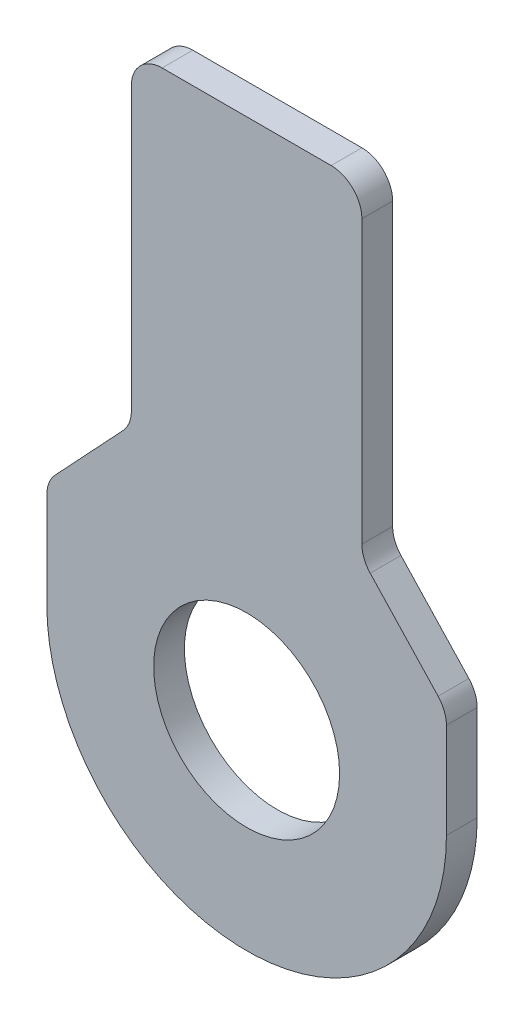
ISO-10303-21;
HEADER;
FILE_DESCRIPTION(('STEP AP214'),'2;1');
FILE_NAME('part.step','',(''),(''),'','','');
FILE_SCHEMA(('AUTOMOTIVE_DESIGN { 1 0 10303 214 1 1 1 1 }'));
ENDSEC;
DATA;
#1=APPLICATION_CONTEXT('core data for automotive mechanical design processes');
#2=APPLICATION_PROTOCOL_DEFINITION('international standard','automotive_design',2000,#1);
#3=PRODUCT_CONTEXT('',#1,'mechanical');
#4=PRODUCT('Part','Part','',(#3));
#5=PRODUCT_RELATED_PRODUCT_CATEGORY('part','',(#4));
#6=PRODUCT_DEFINITION_FORMATION('','',#4);
#7=PRODUCT_DEFINITION_CONTEXT('part definition',#1,'design');
#8=PRODUCT_DEFINITION('design','',#6,#7);
#9=PRODUCT_DEFINITION_SHAPE('','',#8);
#10=(LENGTH_UNIT() NAMED_UNIT(*) SI_UNIT(.MILLI.,.METRE.));
#11=(NAMED_UNIT(*) PLANE_ANGLE_UNIT() SI_UNIT($,.RADIAN.));
#12=(NAMED_UNIT(*) SI_UNIT($,.STERADIAN.) SOLID_ANGLE_UNIT());
#13=UNCERTAINTY_MEASURE_WITH_UNIT(LENGTH_MEASURE(1.E-05),#10,'distance_accuracy_value','');
#14=(GEOMETRIC_REPRESENTATION_CONTEXT(3) GLOBAL_UNCERTAINTY_ASSIGNED_CONTEXT((#13)) GLOBAL_UNIT_ASSIGNED_CONTEXT((#10,
#11,#12)) REPRESENTATION_CONTEXT('',''));
#15=CARTESIAN_POINT('',(0.,0.,0.));
#16=DIRECTION('',(0.,0.,1.));
#17=DIRECTION('',(1.,0.,0.));
#18=AXIS2_PLACEMENT_3D('',#15,#16,#17);
#19=CARTESIAN_POINT('',(0.,0.,-1.));
#20=DIRECTION('',(0.,0.,1.));
#21=DIRECTION('',(1.,0.,0.));
#22=AXIS2_PLACEMENT_3D('',#19,#20,#21);
#23=CYLINDRICAL_SURFACE('',#22,6.5);
#24=CARTESIAN_POINT('',(0.,0.,0.));
#25=DIRECTION('',(0.,0.,1.));
#26=DIRECTION('',(1.,0.,0.));
#27=AXIS2_PLACEMENT_3D('',#24,#25,#26);
#28=CIRCLE('',#27,6.5);
#29=CARTESIAN_POINT('',(-6.5,0.,0.));
#30=VERTEX_POINT('',#29);
#31=CARTESIAN_POINT('',(6.5,0.,0.));
#32=VERTEX_POINT('',#31);
#33=EDGE_CURVE('E183',#30,#32,#28,.T.);
#34=ORIENTED_EDGE('',*,*,#33,.F.);
#35=DIRECTION('',(0.,0.,1.));
#36=VECTOR('',#35,1.);
#37=CARTESIAN_POINT('',(-6.5,0.,-1.));
#38=LINE('',#37,#36);
#39=CARTESIAN_POINT('',(-6.5,0.,-1.));
#40=VERTEX_POINT('',#39);
#41=EDGE_CURVE('E11',#40,#30,#38,.T.);
#42=ORIENTED_EDGE('',*,*,#41,.F.);
#43=CARTESIAN_POINT('',(0.,0.,-1.));
#44=DIRECTION('',(0.,0.,1.));
#45=DIRECTION('',(1.,0.,0.));
#46=AXIS2_PLACEMENT_3D('',#43,#44,#45);
#47=CIRCLE('',#46,6.5);
#48=CARTESIAN_POINT('',(6.5,0.,-1.));
#49=VERTEX_POINT('',#48);
#50=EDGE_CURVE('E235',#40,#49,#47,.T.);
#51=ORIENTED_EDGE('',*,*,#50,.T.);
#52=DIRECTION('',(0.,0.,1.));
#53=VECTOR('',#52,1.);
#54=CARTESIAN_POINT('',(6.5,0.,-1.));
#55=LINE('',#54,#53);
#56=EDGE_CURVE('E45',#49,#32,#55,.T.);
#57=ORIENTED_EDGE('',*,*,#56,.T.);
#58=EDGE_LOOP('',(#34,#42,#51,#57));
#59=FACE_BOUND('',#58,.T.);
#60=ADVANCED_FACE('F42',(#59),#23,.T.);
#61=CARTESIAN_POINT('',(-6.5,3.10504850213721,-1.));
#62=DIRECTION('',(-1.,0.,0.));
#63=DIRECTION('',(0.,0.,1.));
#64=AXIS2_PLACEMENT_3D('',#61,#62,#63);
#65=PLANE('',#64);
#66=DIRECTION('',(0.,-1.,0.));
#67=VECTOR('',#66,1.);
#68=CARTESIAN_POINT('',(-6.5,3.10504850213721,0.));
#69=LINE('',#68,#67);
#70=CARTESIAN_POINT('',(-6.5,3.10504850213721,0.));
#71=VERTEX_POINT('',#70);
#72=EDGE_CURVE('E232',#71,#30,#69,.T.);
#73=ORIENTED_EDGE('',*,*,#72,.F.);
#74=DIRECTION('',(0.,0.,1.));
#75=VECTOR('',#74,1.);
#76=CARTESIAN_POINT('',(-6.5,3.10504850213721,-1.));
#77=LINE('',#76,#75);
#78=CARTESIAN_POINT('',(-6.5,3.10504850213721,-1.));
#79=VERTEX_POINT('',#78);
#80=EDGE_CURVE('E52',#79,#71,#77,.T.);
#81=ORIENTED_EDGE('',*,*,#80,.F.);
#82=DIRECTION('',(0.,-1.,0.));
#83=VECTOR('',#82,1.);
#84=CARTESIAN_POINT('',(-6.5,3.10504850213721,-1.));
#85=LINE('',#84,#83);
#86=EDGE_CURVE('E167',#79,#40,#85,.T.);
#87=ORIENTED_EDGE('',*,*,#86,.T.);
#88=ORIENTED_EDGE('',*,*,#41,.T.);
#89=EDGE_LOOP('',(#73,#81,#87,#88));
#90=FACE_BOUND('',#89,.T.);
#91=ADVANCED_FACE('F271',(#90),#65,.T.);
#92=CARTESIAN_POINT('',(-5.5,3.10504850213721,-1.));
#93=DIRECTION('',(0.,0.,1.));
#94=DIRECTION('',(1.,0.,0.));
#95=AXIS2_PLACEMENT_3D('',#92,#93,#94);
#96=CYLINDRICAL_SURFACE('',#95,0.999999999999999);
#97=CARTESIAN_POINT('',(-5.5,3.10504850213721,0.));
#98=DIRECTION('',(0.,0.,1.));
#99=DIRECTION('',(1.,0.,0.));
#100=AXIS2_PLACEMENT_3D('',#97,#98,#99);
#101=CIRCLE('',#100,0.999999999999999);
#102=CARTESIAN_POINT('',(-6.23012373308702,3.78836346200789,0.));
#103=VERTEX_POINT('',#102);
#104=EDGE_CURVE('E153',#103,#71,#101,.T.);
#105=ORIENTED_EDGE('',*,*,#104,.F.);
#106=DIRECTION('',(0.,0.,1.));
#107=VECTOR('',#106,1.);
#108=CARTESIAN_POINT('',(-6.23012373308702,3.78836346200789,-1.));
#109=LINE('',#108,#107);
#110=CARTESIAN_POINT('',(-6.23012373308702,3.78836346200789,-1.));
#111=VERTEX_POINT('',#110);
#112=EDGE_CURVE('E148',#111,#103,#109,.T.);
#113=ORIENTED_EDGE('',*,*,#112,.F.);
#114=CARTESIAN_POINT('',(-5.5,3.10504850213721,-1.));
#115=DIRECTION('',(0.,0.,1.));
#116=DIRECTION('',(1.,0.,0.));
#117=AXIS2_PLACEMENT_3D('',#114,#115,#116);
#118=CIRCLE('',#117,0.999999999999999);
#119=EDGE_CURVE('E151',#111,#79,#118,.T.);
#120=ORIENTED_EDGE('',*,*,#119,.T.);
#121=ORIENTED_EDGE('',*,*,#80,.T.);
#122=EDGE_LOOP('',(#105,#113,#120,#121));
#123=FACE_BOUND('',#122,.T.);
#124=ADVANCED_FACE('F150',(#123),#96,.T.);
#125=CARTESIAN_POINT('',(-4.01987626691298,6.15001837346265,-1.));
#126=DIRECTION('',(-0.73012373308702,0.683314959870684,0.));
#127=DIRECTION('',(-0.683314959870684,-0.73012373308702,0.));
#128=AXIS2_PLACEMENT_3D('',#125,#126,#127);
#129=PLANE('',#128);
#130=DIRECTION('',(-0.683314959870684,-0.730123733087019,0.));
#131=VECTOR('',#130,1.);
#132=CARTESIAN_POINT('',(-4.01987626691298,6.15001837346265,0.));
#133=LINE('',#132,#131);
#134=CARTESIAN_POINT('',(-4.01987626691298,6.15001837346265,0.));
#135=VERTEX_POINT('',#134);
#136=EDGE_CURVE('E227',#135,#103,#133,.T.);
#137=ORIENTED_EDGE('',*,*,#136,.F.);
#138=DIRECTION('',(0.,0.,1.));
#139=VECTOR('',#138,1.);
#140=CARTESIAN_POINT('',(-4.01987626691298,6.15001837346265,-1.));
#141=LINE('',#140,#139);
#142=CARTESIAN_POINT('',(-4.01987626691298,6.15001837346265,-1.));
#143=VERTEX_POINT('',#142);
#144=EDGE_CURVE('E159',#143,#135,#141,.T.);
#145=ORIENTED_EDGE('',*,*,#144,.F.);
#146=DIRECTION('',(-0.683314959870684,-0.730123733087019,0.));
#147=VECTOR('',#146,1.);
#148=CARTESIAN_POINT('',(-4.01987626691298,6.15001837346265,-1.));
#149=LINE('',#148,#147);
#150=EDGE_CURVE('E165',#143,#111,#149,.T.);
#151=ORIENTED_EDGE('',*,*,#150,.T.);
#152=ORIENTED_EDGE('',*,*,#112,.T.);
#153=EDGE_LOOP('',(#137,#145,#151,#152));
#154=FACE_BOUND('',#153,.T.);
#155=ADVANCED_FACE('F170',(#154),#129,.T.);
#156=CARTESIAN_POINT('',(-4.75,6.83333333333334,-1.));
#157=DIRECTION('',(0.,0.,1.));
#158=DIRECTION('',(1.,0.,0.));
#159=AXIS2_PLACEMENT_3D('',#156,#157,#158);
#160=CYLINDRICAL_SURFACE('',#159,0.999999999999999);
#161=CARTESIAN_POINT('',(-4.75,6.83333333333334,0.));
#162=DIRECTION('',(0.,0.,-1.));
#163=DIRECTION('',(-1.,0.,0.));
#164=AXIS2_PLACEMENT_3D('',#161,#162,#163);
#165=CIRCLE('',#164,0.999999999999999);
#166=CARTESIAN_POINT('',(-3.75,6.83333333333334,0.));
#167=VERTEX_POINT('',#166);
#168=EDGE_CURVE('E223',#167,#135,#165,.T.);
#169=ORIENTED_EDGE('',*,*,#168,.F.);
#170=DIRECTION('',(0.,0.,1.));
#171=VECTOR('',#170,1.);
#172=CARTESIAN_POINT('',(-3.75,6.83333333333334,-1.));
#173=LINE('',#172,#171);
#174=CARTESIAN_POINT('',(-3.75,6.83333333333334,-1.));
#175=VERTEX_POINT('',#174);
#176=EDGE_CURVE('E241',#175,#167,#173,.T.);
#177=ORIENTED_EDGE('',*,*,#176,.F.);
#178=CARTESIAN_POINT('',(-4.75,6.83333333333334,-1.));
#179=DIRECTION('',(0.,0.,-1.));
#180=DIRECTION('',(-1.,0.,0.));
#181=AXIS2_PLACEMENT_3D('',#178,#179,#180);
#182=CIRCLE('',#181,0.999999999999999);
#183=EDGE_CURVE('E172',#175,#143,#182,.T.);
#184=ORIENTED_EDGE('',*,*,#183,.T.);
#185=ORIENTED_EDGE('',*,*,#144,.T.);
#186=EDGE_LOOP('',(#169,#177,#184,#185));
#187=FACE_BOUND('',#186,.T.);
#188=ADVANCED_FACE('F284',(#187),#160,.F.);
#189=CARTESIAN_POINT('',(-3.75,6.83333333333334,-1.));
#190=DIRECTION('',(-1.,0.,0.));
#191=DIRECTION('',(0.,-1.,0.));
#192=AXIS2_PLACEMENT_3D('',#189,#190,#191);
#193=PLANE('',#192);
#194=DIRECTION('',(0.,-1.,0.));
#195=VECTOR('',#194,1.);
#196=CARTESIAN_POINT('',(-3.75,6.83333333333334,0.));
#197=LINE('',#196,#195);
#198=CARTESIAN_POINT('',(-3.75,16.,0.));
#199=VERTEX_POINT('',#198);
#200=EDGE_CURVE('E219',#199,#167,#197,.T.);
#201=ORIENTED_EDGE('',*,*,#200,.F.);
#202=DIRECTION('',(0.,0.,1.));
#203=VECTOR('',#202,1.);
#204=CARTESIAN_POINT('',(-3.75,16.,-1.));
#205=LINE('',#204,#203);
#206=CARTESIAN_POINT('',(-3.75,16.,-1.));
#207=VERTEX_POINT('',#206);
#208=EDGE_CURVE('E244',#207,#199,#205,.T.);
#209=ORIENTED_EDGE('',*,*,#208,.F.);
#210=DIRECTION('',(0.,-1.,0.));
#211=VECTOR('',#210,1.);
#212=CARTESIAN_POINT('',(-3.75,6.83333333333334,-1.));
#213=LINE('',#212,#211);
#214=EDGE_CURVE('E177',#207,#175,#213,.T.);
#215=ORIENTED_EDGE('',*,*,#214,.T.);
#216=ORIENTED_EDGE('',*,*,#176,.T.);
#217=EDGE_LOOP('',(#201,#209,#215,#216));
#218=FACE_BOUND('',#217,.T.);
#219=ADVANCED_FACE('F287',(#218),#193,.T.);
#220=CARTESIAN_POINT('',(-2.75,16.,-1.));
#221=DIRECTION('',(0.,0.,1.));
#222=DIRECTION('',(1.,0.,0.));
#223=AXIS2_PLACEMENT_3D('',#220,#221,#222);
#224=CYLINDRICAL_SURFACE('',#223,1.);
#225=CARTESIAN_POINT('',(-2.75,16.,0.));
#226=DIRECTION('',(0.,0.,1.));
#227=DIRECTION('',(-1.,0.,0.));
#228=AXIS2_PLACEMENT_3D('',#225,#226,#227);
#229=CIRCLE('',#228,1.);
#230=CARTESIAN_POINT('',(-2.75,17.,0.));
#231=VERTEX_POINT('',#230);
#232=EDGE_CURVE('E215',#231,#199,#229,.T.);
#233=ORIENTED_EDGE('',*,*,#232,.F.);
#234=DIRECTION('',(0.,0.,1.));
#235=VECTOR('',#234,1.);
#236=CARTESIAN_POINT('',(-2.75,17.,-1.));
#237=LINE('',#236,#235);
#238=CARTESIAN_POINT('',(-2.75,17.,-1.));
#239=VERTEX_POINT('',#238);
#240=EDGE_CURVE('E247',#239,#231,#237,.T.);
#241=ORIENTED_EDGE('',*,*,#240,.F.);
#242=CARTESIAN_POINT('',(-2.75,16.,-1.));
#243=DIRECTION('',(0.,0.,1.));
#244=DIRECTION('',(-1.,0.,0.));
#245=AXIS2_PLACEMENT_3D('',#242,#243,#244);
#246=CIRCLE('',#245,1.);
#247=EDGE_CURVE('E374',#239,#207,#246,.T.);
#248=ORIENTED_EDGE('',*,*,#247,.T.);
#249=ORIENTED_EDGE('',*,*,#208,.T.);
#250=EDGE_LOOP('',(#233,#241,#248,#249));
#251=FACE_BOUND('',#250,.T.);
#252=ADVANCED_FACE('F291',(#251),#224,.T.);
#253=CARTESIAN_POINT('',(2.75,17.,-1.));
#254=DIRECTION('',(0.,1.,0.));
#255=DIRECTION('',(0.,0.,1.));
#256=AXIS2_PLACEMENT_3D('',#253,#254,#255);
#257=PLANE('',#256);
#258=DIRECTION('',(-1.,0.,0.));
#259=VECTOR('',#258,1.);
#260=CARTESIAN_POINT('',(2.75,17.,0.));
#261=LINE('',#260,#259);
#262=CARTESIAN_POINT('',(2.75,17.,0.));
#263=VERTEX_POINT('',#262);
#264=EDGE_CURVE('E211',#263,#231,#261,.T.);
#265=ORIENTED_EDGE('',*,*,#264,.F.);
#266=DIRECTION('',(0.,0.,1.));
#267=VECTOR('',#266,1.);
#268=CARTESIAN_POINT('',(2.75,17.,-1.));
#269=LINE('',#268,#267);
#270=CARTESIAN_POINT('',(2.75,17.,-1.));
#271=VERTEX_POINT('',#270);
#272=EDGE_CURVE('E249',#271,#263,#269,.T.);
#273=ORIENTED_EDGE('',*,*,#272,.F.);
#274=DIRECTION('',(-1.,0.,0.));
#275=VECTOR('',#274,1.);
#276=CARTESIAN_POINT('',(2.75,17.,-1.));
#277=LINE('',#276,#275);
#278=EDGE_CURVE('E370',#271,#239,#277,.T.);
#279=ORIENTED_EDGE('',*,*,#278,.T.);
#280=ORIENTED_EDGE('',*,*,#240,.T.);
#281=EDGE_LOOP('',(#265,#273,#279,#280));
#282=FACE_BOUND('',#281,.T.);
#283=ADVANCED_FACE('F295',(#282),#257,.T.);
#284=CARTESIAN_POINT('',(2.75,16.,-1.));
#285=DIRECTION('',(0.,0.,1.));
#286=DIRECTION('',(1.,0.,0.));
#287=AXIS2_PLACEMENT_3D('',#284,#285,#286);
#288=CYLINDRICAL_SURFACE('',#287,1.);
#289=CARTESIAN_POINT('',(2.75,16.,0.));
#290=DIRECTION('',(0.,0.,1.));
#291=DIRECTION('',(-1.,0.,0.));
#292=AXIS2_PLACEMENT_3D('',#289,#290,#291);
#293=CIRCLE('',#292,1.);
#294=CARTESIAN_POINT('',(3.75,16.,0.));
#295=VERTEX_POINT('',#294);
#296=EDGE_CURVE('E207',#295,#263,#293,.T.);
#297=ORIENTED_EDGE('',*,*,#296,.F.);
#298=DIRECTION('',(0.,0.,1.));
#299=VECTOR('',#298,1.);
#300=CARTESIAN_POINT('',(3.75,16.,-1.));
#301=LINE('',#300,#299);
#302=CARTESIAN_POINT('',(3.75,16.,-1.));
#303=VERTEX_POINT('',#302);
#304=EDGE_CURVE('E252',#303,#295,#301,.T.);
#305=ORIENTED_EDGE('',*,*,#304,.F.);
#306=CARTESIAN_POINT('',(2.75,16.,-1.));
#307=DIRECTION('',(0.,0.,1.));
#308=DIRECTION('',(-1.,0.,0.));
#309=AXIS2_PLACEMENT_3D('',#306,#307,#308);
#310=CIRCLE('',#309,1.);
#311=EDGE_CURVE('E366',#303,#271,#310,.T.);
#312=ORIENTED_EDGE('',*,*,#311,.T.);
#313=ORIENTED_EDGE('',*,*,#272,.T.);
#314=EDGE_LOOP('',(#297,#305,#312,#313));
#315=FACE_BOUND('',#314,.T.);
#316=ADVANCED_FACE('F299',(#315),#288,.T.);
#317=CARTESIAN_POINT('',(3.75,6.83333333333334,-1.));
#318=DIRECTION('',(1.,0.,0.));
#319=DIRECTION('',(0.,1.,0.));
#320=AXIS2_PLACEMENT_3D('',#317,#318,#319);
#321=PLANE('',#320);
#322=DIRECTION('',(0.,1.,0.));
#323=VECTOR('',#322,1.);
#324=CARTESIAN_POINT('',(3.75,6.83333333333334,0.));
#325=LINE('',#324,#323);
#326=CARTESIAN_POINT('',(3.75,6.83333333333334,0.));
#327=VERTEX_POINT('',#326);
#328=EDGE_CURVE('E203',#327,#295,#325,.T.);
#329=ORIENTED_EDGE('',*,*,#328,.F.);
#330=DIRECTION('',(0.,0.,1.));
#331=VECTOR('',#330,1.);
#332=CARTESIAN_POINT('',(3.75,6.83333333333334,-1.));
#333=LINE('',#332,#331);
#334=CARTESIAN_POINT('',(3.75,6.83333333333334,-1.));
#335=VERTEX_POINT('',#334);
#336=EDGE_CURVE('E255',#335,#327,#333,.T.);
#337=ORIENTED_EDGE('',*,*,#336,.F.);
#338=DIRECTION('',(0.,1.,0.));
#339=VECTOR('',#338,1.);
#340=CARTESIAN_POINT('',(3.75,6.83333333333334,-1.));
#341=LINE('',#340,#339);
#342=EDGE_CURVE('E362',#335,#303,#341,.T.);
#343=ORIENTED_EDGE('',*,*,#342,.T.);
#344=ORIENTED_EDGE('',*,*,#304,.T.);
#345=EDGE_LOOP('',(#329,#337,#343,#344));
#346=FACE_BOUND('',#345,.T.);
#347=ADVANCED_FACE('F303',(#346),#321,.T.);
#348=CARTESIAN_POINT('',(4.75,6.83333333333334,-1.));
#349=DIRECTION('',(0.,0.,1.));
#350=DIRECTION('',(1.,0.,0.));
#351=AXIS2_PLACEMENT_3D('',#348,#349,#350);
#352=CYLINDRICAL_SURFACE('',#351,0.999999999999999);
#353=CARTESIAN_POINT('',(4.75,6.83333333333334,0.));
#354=DIRECTION('',(0.,0.,-1.));
#355=DIRECTION('',(-1.,0.,0.));
#356=AXIS2_PLACEMENT_3D('',#353,#354,#355);
#357=CIRCLE('',#356,0.999999999999999);
#358=CARTESIAN_POINT('',(4.01987626691298,6.15001837346265,0.));
#359=VERTEX_POINT('',#358);
#360=EDGE_CURVE('E199',#359,#327,#357,.T.);
#361=ORIENTED_EDGE('',*,*,#360,.F.);
#362=DIRECTION('',(0.,0.,1.));
#363=VECTOR('',#362,1.);
#364=CARTESIAN_POINT('',(4.01987626691298,6.15001837346265,-1.));
#365=LINE('',#364,#363);
#366=CARTESIAN_POINT('',(4.01987626691298,6.15001837346265,-1.));
#367=VERTEX_POINT('',#366);
#368=EDGE_CURVE('E258',#367,#359,#365,.T.);
#369=ORIENTED_EDGE('',*,*,#368,.F.);
#370=CARTESIAN_POINT('',(4.75,6.83333333333334,-1.));
#371=DIRECTION('',(0.,0.,-1.));
#372=DIRECTION('',(-1.,0.,0.));
#373=AXIS2_PLACEMENT_3D('',#370,#371,#372);
#374=CIRCLE('',#373,0.999999999999999);
#375=EDGE_CURVE('E358',#367,#335,#374,.T.);
#376=ORIENTED_EDGE('',*,*,#375,.T.);
#377=ORIENTED_EDGE('',*,*,#336,.T.);
#378=EDGE_LOOP('',(#361,#369,#376,#377));
#379=FACE_BOUND('',#378,.T.);
#380=ADVANCED_FACE('F307',(#379),#352,.F.);
#381=CARTESIAN_POINT('',(6.23012373308702,3.78836346200789,-1.));
#382=DIRECTION('',(0.73012373308702,0.683314959870684,0.));
#383=DIRECTION('',(-0.683314959870684,0.73012373308702,0.));
#384=AXIS2_PLACEMENT_3D('',#381,#382,#383);
#385=PLANE('',#384);
#386=DIRECTION('',(-0.683314959870684,0.730123733087019,0.));
#387=VECTOR('',#386,1.);
#388=CARTESIAN_POINT('',(6.23012373308702,3.78836346200789,0.));
#389=LINE('',#388,#387);
#390=CARTESIAN_POINT('',(6.23012373308702,3.78836346200789,0.));
#391=VERTEX_POINT('',#390);
#392=EDGE_CURVE('E195',#391,#359,#389,.T.);
#393=ORIENTED_EDGE('',*,*,#392,.F.);
#394=DIRECTION('',(0.,0.,1.));
#395=VECTOR('',#394,1.);
#396=CARTESIAN_POINT('',(6.23012373308702,3.78836346200789,-1.));
#397=LINE('',#396,#395);
#398=CARTESIAN_POINT('',(6.23012373308702,3.78836346200789,-1.));
#399=VERTEX_POINT('',#398);
#400=EDGE_CURVE('E261',#399,#391,#397,.T.);
#401=ORIENTED_EDGE('',*,*,#400,.F.);
#402=DIRECTION('',(-0.683314959870684,0.730123733087019,0.));
#403=VECTOR('',#402,1.);
#404=CARTESIAN_POINT('',(6.23012373308702,3.78836346200789,-1.));
#405=LINE('',#404,#403);
#406=EDGE_CURVE('E354',#399,#367,#405,.T.);
#407=ORIENTED_EDGE('',*,*,#406,.T.);
#408=ORIENTED_EDGE('',*,*,#368,.T.);
#409=EDGE_LOOP('',(#393,#401,#407,#408));
#410=FACE_BOUND('',#409,.T.);
#411=ADVANCED_FACE('F311',(#410),#385,.T.);
#412=CARTESIAN_POINT('',(5.5,3.10504850213721,-1.));
#413=DIRECTION('',(0.,0.,1.));
#414=DIRECTION('',(1.,0.,0.));
#415=AXIS2_PLACEMENT_3D('',#412,#413,#414);
#416=CYLINDRICAL_SURFACE('',#415,0.999999999999999);
#417=CARTESIAN_POINT('',(5.5,3.10504850213721,0.));
#418=DIRECTION('',(0.,0.,1.));
#419=DIRECTION('',(-1.,0.,0.));
#420=AXIS2_PLACEMENT_3D('',#417,#418,#419);
#421=CIRCLE('',#420,0.999999999999999);
#422=CARTESIAN_POINT('',(6.5,3.10504850213721,0.));
#423=VERTEX_POINT('',#422);
#424=EDGE_CURVE('E191',#423,#391,#421,.T.);
#425=ORIENTED_EDGE('',*,*,#424,.F.);
#426=DIRECTION('',(0.,0.,1.));
#427=VECTOR('',#426,1.);
#428=CARTESIAN_POINT('',(6.5,3.10504850213721,-1.));
#429=LINE('',#428,#427);
#430=CARTESIAN_POINT('',(6.5,3.10504850213721,-1.));
#431=VERTEX_POINT('',#430);
#432=EDGE_CURVE('E263',#431,#423,#429,.T.);
#433=ORIENTED_EDGE('',*,*,#432,.F.);
#434=CARTESIAN_POINT('',(5.5,3.10504850213721,-1.));
#435=DIRECTION('',(0.,0.,1.));
#436=DIRECTION('',(-1.,0.,0.));
#437=AXIS2_PLACEMENT_3D('',#434,#435,#436);
#438=CIRCLE('',#437,0.999999999999999);
#439=EDGE_CURVE('E350',#431,#399,#438,.T.);
#440=ORIENTED_EDGE('',*,*,#439,.T.);
#441=ORIENTED_EDGE('',*,*,#400,.T.);
#442=EDGE_LOOP('',(#425,#433,#440,#441));
#443=FACE_BOUND('',#442,.T.);
#444=ADVANCED_FACE('F315',(#443),#416,.T.);
#445=CARTESIAN_POINT('',(6.5,0.,-1.));
#446=DIRECTION('',(1.,0.,0.));
#447=DIRECTION('',(0.,0.,-1.));
#448=AXIS2_PLACEMENT_3D('',#445,#446,#447);
#449=PLANE('',#448);
#450=DIRECTION('',(0.,1.,0.));
#451=VECTOR('',#450,1.);
#452=CARTESIAN_POINT('',(6.5,0.,0.));
#453=LINE('',#452,#451);
#454=EDGE_CURVE('E186',#32,#423,#453,.T.);
#455=ORIENTED_EDGE('',*,*,#454,.F.);
#456=ORIENTED_EDGE('',*,*,#56,.F.);
#457=DIRECTION('',(0.,1.,0.));
#458=VECTOR('',#457,1.);
#459=CARTESIAN_POINT('',(6.5,0.,-1.));
#460=LINE('',#459,#458);
#461=EDGE_CURVE('E347',#49,#431,#460,.T.);
#462=ORIENTED_EDGE('',*,*,#461,.T.);
#463=ORIENTED_EDGE('',*,*,#432,.T.);
#464=EDGE_LOOP('',(#455,#456,#462,#463));
#465=FACE_BOUND('',#464,.T.);
#466=ADVANCED_FACE('F268',(#465),#449,.T.);
#467=CARTESIAN_POINT('',(0.,0.,-1.));
#468=DIRECTION('',(0.,0.,1.));
#469=DIRECTION('',(1.,0.,0.));
#470=AXIS2_PLACEMENT_3D('',#467,#468,#469);
#471=PLANE('',#470);
#472=CARTESIAN_POINT('',(0.,0.,-1.));
#473=DIRECTION('',(0.,0.,1.));
#474=DIRECTION('',(1.,0.,0.));
#475=AXIS2_PLACEMENT_3D('',#472,#473,#474);
#476=CIRCLE('',#475,3.025);
#477=CARTESIAN_POINT('',(3.025,0.,-1.));
#478=VERTEX_POINT('',#477);
#479=EDGE_CURVE('E187',#478,#478,#476,.T.);
#480=ORIENTED_EDGE('',*,*,#479,.T.);
#481=EDGE_LOOP('',(#480));
#482=FACE_BOUND('',#481,.T.);
#483=ORIENTED_EDGE('',*,*,#50,.F.);
#484=ORIENTED_EDGE('',*,*,#86,.F.);
#485=ORIENTED_EDGE('',*,*,#119,.F.);
#486=ORIENTED_EDGE('',*,*,#150,.F.);
#487=ORIENTED_EDGE('',*,*,#183,.F.);
#488=ORIENTED_EDGE('',*,*,#214,.F.);
#489=ORIENTED_EDGE('',*,*,#247,.F.);
#490=ORIENTED_EDGE('',*,*,#278,.F.);
#491=ORIENTED_EDGE('',*,*,#311,.F.);
#492=ORIENTED_EDGE('',*,*,#342,.F.);
#493=ORIENTED_EDGE('',*,*,#375,.F.);
#494=ORIENTED_EDGE('',*,*,#406,.F.);
#495=ORIENTED_EDGE('',*,*,#439,.F.);
#496=ORIENTED_EDGE('',*,*,#461,.F.);
#497=EDGE_LOOP('',(#483,#484,#485,#486,#487,#488,#489,#490,#491,#492,#493,#494,#495,#496));
#498=FACE_BOUND('',#497,.T.);
#499=ADVANCED_FACE('F163',(#482,#498),#471,.F.);
#500=CARTESIAN_POINT('',(0.,0.,0.));
#501=DIRECTION('',(0.,0.,1.));
#502=DIRECTION('',(1.,0.,0.));
#503=AXIS2_PLACEMENT_3D('',#500,#501,#502);
#504=PLANE('',#503);
#505=CARTESIAN_POINT('',(0.,0.,0.));
#506=DIRECTION('',(0.,0.,1.));
#507=DIRECTION('',(1.,0.,0.));
#508=AXIS2_PLACEMENT_3D('',#505,#506,#507);
#509=CIRCLE('',#508,3.025);
#510=CARTESIAN_POINT('',(3.025,0.,0.));
#511=VERTEX_POINT('',#510);
#512=EDGE_CURVE('E339',#511,#511,#509,.T.);
#513=ORIENTED_EDGE('',*,*,#512,.F.);
#514=EDGE_LOOP('',(#513));
#515=FACE_BOUND('',#514,.T.);
#516=ORIENTED_EDGE('',*,*,#33,.T.);
#517=ORIENTED_EDGE('',*,*,#454,.T.);
#518=ORIENTED_EDGE('',*,*,#424,.T.);
#519=ORIENTED_EDGE('',*,*,#392,.T.);
#520=ORIENTED_EDGE('',*,*,#360,.T.);
#521=ORIENTED_EDGE('',*,*,#328,.T.);
#522=ORIENTED_EDGE('',*,*,#296,.T.);
#523=ORIENTED_EDGE('',*,*,#264,.T.);
#524=ORIENTED_EDGE('',*,*,#232,.T.);
#525=ORIENTED_EDGE('',*,*,#200,.T.);
#526=ORIENTED_EDGE('',*,*,#168,.T.);
#527=ORIENTED_EDGE('',*,*,#136,.T.);
#528=ORIENTED_EDGE('',*,*,#104,.T.);
#529=ORIENTED_EDGE('',*,*,#72,.T.);
#530=EDGE_LOOP('',(#516,#517,#518,#519,#520,#521,#522,#523,#524,#525,#526,#527,#528,#529));
#531=FACE_BOUND('',#530,.T.);
#532=ADVANCED_FACE('F270',(#515,#531),#504,.T.);
#533=CARTESIAN_POINT('',(0.,0.,-1.));
#534=DIRECTION('',(0.,0.,1.));
#535=DIRECTION('',(1.,0.,0.));
#536=AXIS2_PLACEMENT_3D('',#533,#534,#535);
#537=CYLINDRICAL_SURFACE('',#536,3.025);
#538=ORIENTED_EDGE('',*,*,#479,.F.);
#539=EDGE_LOOP('',(#538));
#540=FACE_BOUND('',#539,.T.);
#541=ORIENTED_EDGE('',*,*,#512,.T.);
#542=EDGE_LOOP('',(#541));
#543=FACE_BOUND('',#542,.T.);
#544=ADVANCED_FACE('F327',(#540,#543),#537,.F.);
#545=CLOSED_SHELL('',(#60,#91,#124,#155,#188,#219,#252,#283,#316,#347,#380,#411,#444,#466,#499,
#532,#544));
#546=MANIFOLD_SOLID_BREP('B2',#545);
#547=ADVANCED_BREP_SHAPE_REPRESENTATION('',(#18,#546),#14);
#548=SHAPE_DEFINITION_REPRESENTATION(#9,#547);
ENDSEC;
END-ISO-10303-21;
